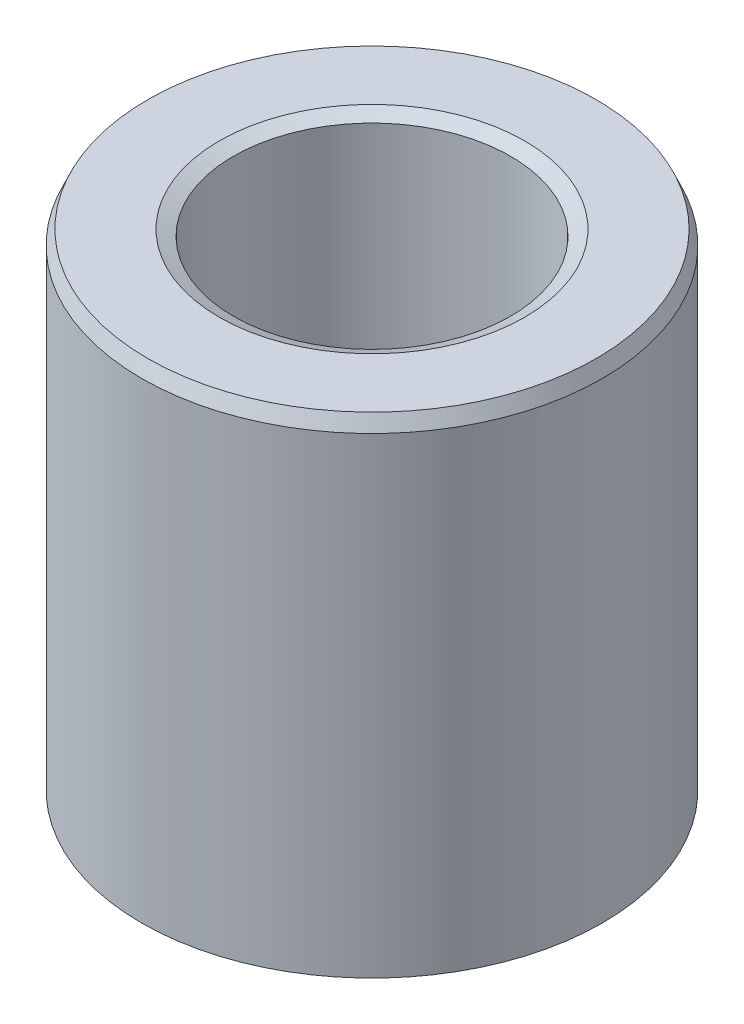
ISO-10303-21;
HEADER;
FILE_DESCRIPTION(('STEP AP214'),'2;1');
FILE_NAME('part.step','',(''),(''),'','','');
FILE_SCHEMA(('AUTOMOTIVE_DESIGN { 1 0 10303 214 1 1 1 1 }'));
ENDSEC;
DATA;
#1=APPLICATION_CONTEXT('core data for automotive mechanical design processes');
#2=APPLICATION_PROTOCOL_DEFINITION('international standard','automotive_design',2000,#1);
#3=PRODUCT_CONTEXT('',#1,'mechanical');
#4=PRODUCT('Part','Part','',(#3));
#5=PRODUCT_RELATED_PRODUCT_CATEGORY('part','',(#4));
#6=PRODUCT_DEFINITION_FORMATION('','',#4);
#7=PRODUCT_DEFINITION_CONTEXT('part definition',#1,'design');
#8=PRODUCT_DEFINITION('design','',#6,#7);
#9=PRODUCT_DEFINITION_SHAPE('','',#8);
#10=(LENGTH_UNIT() NAMED_UNIT(*) SI_UNIT(.MILLI.,.METRE.));
#11=(NAMED_UNIT(*) PLANE_ANGLE_UNIT() SI_UNIT($,.RADIAN.));
#12=(NAMED_UNIT(*) SI_UNIT($,.STERADIAN.) SOLID_ANGLE_UNIT());
#13=UNCERTAINTY_MEASURE_WITH_UNIT(LENGTH_MEASURE(1.E-05),#10,'distance_accuracy_value','');
#14=(GEOMETRIC_REPRESENTATION_CONTEXT(3) GLOBAL_UNCERTAINTY_ASSIGNED_CONTEXT((#13)) GLOBAL_UNIT_ASSIGNED_CONTEXT((#10,
#11,#12)) REPRESENTATION_CONTEXT('',''));
#15=CARTESIAN_POINT('',(0.,0.,0.));
#16=DIRECTION('',(0.,0.,1.));
#17=DIRECTION('',(1.,0.,0.));
#18=AXIS2_PLACEMENT_3D('',#15,#16,#17);
#19=CARTESIAN_POINT('',(0.,69.3833002856814,0.));
#20=DIRECTION('',(0.,-1.,0.));
#21=DIRECTION('',(0.,0.,-1.));
#22=AXIS2_PLACEMENT_3D('',#19,#20,#21);
#23=CYLINDRICAL_SURFACE('',#22,32.5);
#24=CARTESIAN_POINT('',(0.,0.87484045415559,0.));
#25=DIRECTION('',(0.,1.,0.));
#26=DIRECTION('',(0.,0.,1.));
#27=AXIS2_PLACEMENT_3D('',#24,#25,#26);
#28=CIRCLE('',#27,32.5);
#29=CARTESIAN_POINT('',(0.,0.87484045415559,32.5));
#30=VERTEX_POINT('',#29);
#31=EDGE_CURVE('E10',#30,#30,#28,.T.);
#32=ORIENTED_EDGE('',*,*,#31,.T.);
#33=EDGE_LOOP('',(#32));
#34=FACE_BOUND('',#33,.T.);
#35=CARTESIAN_POINT('',(0.,67.3903049914212,0.));
#36=DIRECTION('',(0.,1.,0.));
#37=DIRECTION('',(0.,0.,1.));
#38=AXIS2_PLACEMENT_3D('',#35,#36,#37);
#39=CIRCLE('',#38,32.5);
#40=CARTESIAN_POINT('',(0.,67.3903049914212,32.5));
#41=VERTEX_POINT('',#40);
#42=EDGE_CURVE('E50',#41,#41,#39,.F.);
#43=ORIENTED_EDGE('',*,*,#42,.T.);
#44=EDGE_LOOP('',(#43));
#45=FACE_BOUND('',#44,.T.);
#46=ADVANCED_FACE('F39',(#34,#45),#23,.T.);
#47=CARTESIAN_POINT('',(0.,69.3833002856814,0.));
#48=DIRECTION('',(0.,1.,0.));
#49=DIRECTION('',(0.,0.,1.));
#50=AXIS2_PLACEMENT_3D('',#47,#48,#49);
#51=PLANE('',#50);
#52=CARTESIAN_POINT('',(0.,69.3833002856814,0.));
#53=DIRECTION('',(0.,1.,0.));
#54=DIRECTION('',(0.,0.,1.));
#55=AXIS2_PLACEMENT_3D('',#52,#53,#54);
#56=CIRCLE('',#55,21.5425316511003);
#57=CARTESIAN_POINT('',(0.,69.3833002856814,21.5425316511003));
#58=VERTEX_POINT('',#57);
#59=EDGE_CURVE('E58',#58,#58,#56,.F.);
#60=ORIENTED_EDGE('',*,*,#59,.T.);
#61=EDGE_LOOP('',(#60));
#62=FACE_BOUND('',#61,.T.);
#63=CARTESIAN_POINT('',(0.,69.3833002856814,0.));
#64=DIRECTION('',(0.,1.,0.));
#65=DIRECTION('',(0.,0.,1.));
#66=AXIS2_PLACEMENT_3D('',#63,#64,#65);
#67=CIRCLE('',#66,31.6251595458444);
#68=CARTESIAN_POINT('',(0.,69.3833002856814,31.6251595458444));
#69=VERTEX_POINT('',#68);
#70=EDGE_CURVE('E61',#69,#69,#67,.T.);
#71=ORIENTED_EDGE('',*,*,#70,.T.);
#72=EDGE_LOOP('',(#71));
#73=FACE_BOUND('',#72,.T.);
#74=ADVANCED_FACE('F88',(#62,#73),#51,.T.);
#75=CARTESIAN_POINT('',(0.,0.,0.));
#76=DIRECTION('',(0.,1.,0.));
#77=DIRECTION('',(0.,0.,1.));
#78=AXIS2_PLACEMENT_3D('',#75,#76,#77);
#79=PLANE('',#78);
#80=CARTESIAN_POINT('',(0.,0.,0.));
#81=DIRECTION('',(0.,1.,0.));
#82=DIRECTION('',(0.,0.,1.));
#83=AXIS2_PLACEMENT_3D('',#80,#81,#82);
#84=CIRCLE('',#83,20.4243768109958);
#85=CARTESIAN_POINT('',(0.,0.,20.4243768109958));
#86=VERTEX_POINT('',#85);
#87=EDGE_CURVE('E51',#86,#86,#84,.T.);
#88=ORIENTED_EDGE('',*,*,#87,.T.);
#89=EDGE_LOOP('',(#88));
#90=FACE_BOUND('',#89,.T.);
#91=CARTESIAN_POINT('',(0.,0.,0.));
#92=DIRECTION('',(0.,1.,0.));
#93=DIRECTION('',(0.,0.,1.));
#94=AXIS2_PLACEMENT_3D('',#91,#92,#93);
#95=CIRCLE('',#94,30.5070047057399);
#96=CARTESIAN_POINT('',(0.,0.,30.5070047057399));
#97=VERTEX_POINT('',#96);
#98=EDGE_CURVE('E54',#97,#97,#95,.F.);
#99=ORIENTED_EDGE('',*,*,#98,.T.);
#100=EDGE_LOOP('',(#99));
#101=FACE_BOUND('',#100,.T.);
#102=ADVANCED_FACE('F83',(#90,#101),#79,.F.);
#103=CARTESIAN_POINT('',(0.,69.3833002856814,0.));
#104=DIRECTION('',(0.,-1.,0.));
#105=DIRECTION('',(0.,0.,-1.));
#106=AXIS2_PLACEMENT_3D('',#103,#104,#105);
#107=CYLINDRICAL_SURFACE('',#106,19.5495363568402);
#108=CARTESIAN_POINT('',(0.,68.5084598315258,0.));
#109=DIRECTION('',(0.,1.,0.));
#110=DIRECTION('',(0.,0.,1.));
#111=AXIS2_PLACEMENT_3D('',#108,#109,#110);
#112=CIRCLE('',#111,19.5495363568402);
#113=CARTESIAN_POINT('',(0.,68.5084598315258,19.5495363568402));
#114=VERTEX_POINT('',#113);
#115=EDGE_CURVE('E67',#114,#114,#112,.T.);
#116=ORIENTED_EDGE('',*,*,#115,.T.);
#117=EDGE_LOOP('',(#116));
#118=FACE_BOUND('',#117,.T.);
#119=CARTESIAN_POINT('',(0.,1.99299529426011,0.));
#120=DIRECTION('',(0.,1.,0.));
#121=DIRECTION('',(0.,0.,1.));
#122=AXIS2_PLACEMENT_3D('',#119,#120,#121);
#123=CIRCLE('',#122,19.5495363568402);
#124=CARTESIAN_POINT('',(0.,1.99299529426011,19.5495363568402));
#125=VERTEX_POINT('',#124);
#126=EDGE_CURVE('E69',#125,#125,#123,.F.);
#127=ORIENTED_EDGE('',*,*,#126,.T.);
#128=EDGE_LOOP('',(#127));
#129=FACE_BOUND('',#128,.T.);
#130=ADVANCED_FACE('F71',(#118,#129),#107,.F.);
#131=CARTESIAN_POINT('',(0.,68.5084598315258,0.));
#132=DIRECTION('',(0.,1.,0.));
#133=DIRECTION('',(0.,0.,1.));
#134=AXIS2_PLACEMENT_3D('',#131,#132,#133);
#135=CONICAL_SURFACE('',#134,19.5495363568402,1.15716310243378);
#136=ORIENTED_EDGE('',*,*,#59,.F.);
#137=EDGE_LOOP('',(#136));
#138=FACE_BOUND('',#137,.T.);
#139=ORIENTED_EDGE('',*,*,#115,.F.);
#140=EDGE_LOOP('',(#139));
#141=FACE_BOUND('',#140,.T.);
#142=ADVANCED_FACE('F77',(#138,#141),#135,.F.);
#143=CARTESIAN_POINT('',(0.,0.,0.));
#144=DIRECTION('',(0.,-1.,0.));
#145=DIRECTION('',(0.,0.,-1.));
#146=AXIS2_PLACEMENT_3D('',#143,#144,#145);
#147=CONICAL_SURFACE('',#146,20.4243768109958,0.413633224361122);
#148=ORIENTED_EDGE('',*,*,#126,.F.);
#149=EDGE_LOOP('',(#148));
#150=FACE_BOUND('',#149,.T.);
#151=ORIENTED_EDGE('',*,*,#87,.F.);
#152=EDGE_LOOP('',(#151));
#153=FACE_BOUND('',#152,.T.);
#154=ADVANCED_FACE('F73',(#150,#153),#147,.F.);
#155=CARTESIAN_POINT('',(0.,0.87484045415559,0.));
#156=DIRECTION('',(0.,1.,0.));
#157=DIRECTION('',(0.,0.,1.));
#158=AXIS2_PLACEMENT_3D('',#155,#156,#157);
#159=CONICAL_SURFACE('',#158,32.5,1.15716310243378);
#160=ORIENTED_EDGE('',*,*,#98,.F.);
#161=EDGE_LOOP('',(#160));
#162=FACE_BOUND('',#161,.T.);
#163=ORIENTED_EDGE('',*,*,#31,.F.);
#164=EDGE_LOOP('',(#163));
#165=FACE_BOUND('',#164,.T.);
#166=ADVANCED_FACE('F76',(#162,#165),#159,.T.);
#167=CARTESIAN_POINT('',(0.,69.3833002856814,0.));
#168=DIRECTION('',(0.,-1.,0.));
#169=DIRECTION('',(0.,0.,-1.));
#170=AXIS2_PLACEMENT_3D('',#167,#168,#169);
#171=CONICAL_SURFACE('',#170,31.6251595458444,0.413633224361129);
#172=ORIENTED_EDGE('',*,*,#42,.F.);
#173=EDGE_LOOP('',(#172));
#174=FACE_BOUND('',#173,.T.);
#175=ORIENTED_EDGE('',*,*,#70,.F.);
#176=EDGE_LOOP('',(#175));
#177=FACE_BOUND('',#176,.T.);
#178=ADVANCED_FACE('F45',(#174,#177),#171,.T.);
#179=CLOSED_SHELL('',(#46,#74,#102,#130,#142,#154,#166,#178));
#180=MANIFOLD_SOLID_BREP('B2',#179);
#181=ADVANCED_BREP_SHAPE_REPRESENTATION('',(#18,#180),#14);
#182=SHAPE_DEFINITION_REPRESENTATION(#9,#181);
ENDSEC;
END-ISO-10303-21;
